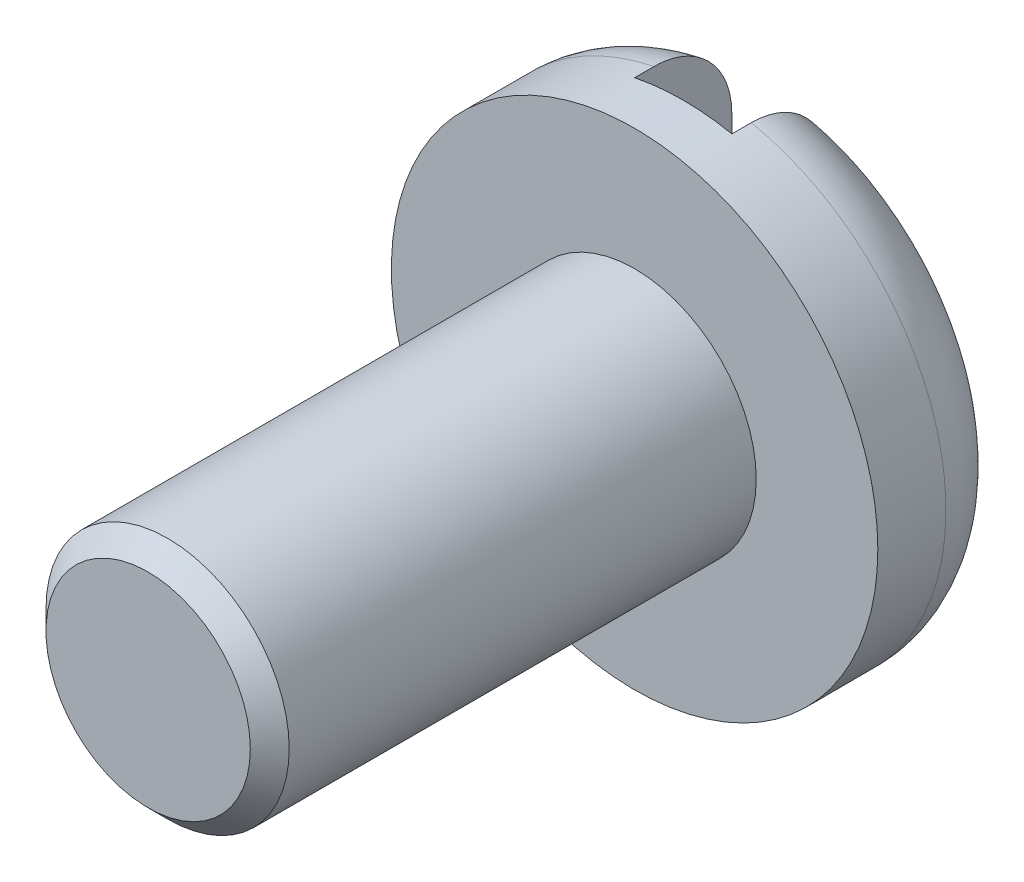
ISO-10303-21;
HEADER;
FILE_DESCRIPTION(('STEP AP214'),'2;1');
FILE_NAME('part.step','',(''),(''),'','','');
FILE_SCHEMA(('AUTOMOTIVE_DESIGN { 1 0 10303 214 1 1 1 1 }'));
ENDSEC;
DATA;
#1=APPLICATION_CONTEXT('core data for automotive mechanical design processes');
#2=APPLICATION_PROTOCOL_DEFINITION('international standard','automotive_design',2000,#1);
#3=PRODUCT_CONTEXT('',#1,'mechanical');
#4=PRODUCT('Part','Part','',(#3));
#5=PRODUCT_RELATED_PRODUCT_CATEGORY('part','',(#4));
#6=PRODUCT_DEFINITION_FORMATION('','',#4);
#7=PRODUCT_DEFINITION_CONTEXT('part definition',#1,'design');
#8=PRODUCT_DEFINITION('design','',#6,#7);
#9=PRODUCT_DEFINITION_SHAPE('','',#8);
#10=(LENGTH_UNIT() NAMED_UNIT(*) SI_UNIT(.MILLI.,.METRE.));
#11=(NAMED_UNIT(*) PLANE_ANGLE_UNIT() SI_UNIT($,.RADIAN.));
#12=(NAMED_UNIT(*) SI_UNIT($,.STERADIAN.) SOLID_ANGLE_UNIT());
#13=UNCERTAINTY_MEASURE_WITH_UNIT(LENGTH_MEASURE(1.E-05),#10,'distance_accuracy_value','');
#14=(GEOMETRIC_REPRESENTATION_CONTEXT(3) GLOBAL_UNCERTAINTY_ASSIGNED_CONTEXT((#13)) GLOBAL_UNIT_ASSIGNED_CONTEXT((#10,
#11,#12)) REPRESENTATION_CONTEXT('',''));
#15=CARTESIAN_POINT('',(0.,0.,0.));
#16=DIRECTION('',(0.,0.,1.));
#17=DIRECTION('',(1.,0.,0.));
#18=AXIS2_PLACEMENT_3D('',#15,#16,#17);
#19=CARTESIAN_POINT('',(0.,0.,0.));
#20=DIRECTION('',(0.,0.,1.));
#21=DIRECTION('',(1.,0.,0.));
#22=AXIS2_PLACEMENT_3D('',#19,#20,#21);
#23=PLANE('',#22);
#24=CARTESIAN_POINT('',(0.,0.,0.));
#25=DIRECTION('',(0.,0.,1.));
#26=DIRECTION('',(1.,0.,0.));
#27=AXIS2_PLACEMENT_3D('',#24,#25,#26);
#28=CIRCLE('',#27,1.7);
#29=CARTESIAN_POINT('',(-0.500000000000001,-1.62480768092719,0.));
#30=VERTEX_POINT('',#29);
#31=CARTESIAN_POINT('',(-0.500000000000001,1.62480768092719,0.));
#32=VERTEX_POINT('',#31);
#33=EDGE_CURVE('E109',#30,#32,#28,.F.);
#34=ORIENTED_EDGE('',*,*,#33,.T.);
#35=DIRECTION('',(0.,1.,0.));
#36=VECTOR('',#35,1.);
#37=CARTESIAN_POINT('',(-0.500000000000001,-2.5,0.));
#38=LINE('',#37,#36);
#39=EDGE_CURVE('E97',#30,#32,#38,.T.);
#40=ORIENTED_EDGE('',*,*,#39,.F.);
#41=EDGE_LOOP('',(#34,#40));
#42=FACE_BOUND('',#41,.T.);
#43=ADVANCED_FACE('F35',(#42),#23,.F.);
#44=CARTESIAN_POINT('',(0.,0.,0.8));
#45=DIRECTION('',(0.,0.,1.));
#46=DIRECTION('',(1.,0.,0.));
#47=AXIS2_PLACEMENT_3D('',#44,#45,#46);
#48=TOROIDAL_SURFACE('',#47,1.7,0.8);
#49=CARTESIAN_POINT('',(-0.500000000000001,-2.28874331554241,0.323650819477696));
#50=CARTESIAN_POINT('',(-0.500000000000001,-2.26114036429893,0.287268339331975));
#51=CARTESIAN_POINT('',(-0.500000000000001,-2.23039171511453,0.253243435037022));
#52=CARTESIAN_POINT('',(-0.500000000000001,-2.16356464521695,0.190870488722704));
#53=CARTESIAN_POINT('',(-0.500000000000001,-2.12748142920119,0.16252760891392));
#54=CARTESIAN_POINT('',(-0.500000000000001,-2.05114665205814,0.112302654126743));
#55=CARTESIAN_POINT('',(-0.500000000000001,-2.01090116213952,0.0904113433657712));
#56=CARTESIAN_POINT('',(-0.500000000000001,-1.92737765176059,0.0535347437293057));
#57=CARTESIAN_POINT('',(-0.500000000000001,-1.88410002914012,0.0385485507952723));
#58=CARTESIAN_POINT('',(-0.500000000000001,-1.79470614017092,0.0154852560090506));
#59=CARTESIAN_POINT('',(-0.500000000000001,-1.74854792735717,0.00757107878282026));
#60=CARTESIAN_POINT('',(-0.500000000000001,-1.6555620335874,-0.000715816322389249));
#61=CARTESIAN_POINT('',(-0.500000000000001,-1.6087342199035,-0.00108701770510398));
#62=CARTESIAN_POINT('',(-0.500000000000001,-1.51373377544026,0.00569146088522754));
#63=CARTESIAN_POINT('',(-0.500000000000001,-1.46558284561454,0.0131443513534284));
#64=CARTESIAN_POINT('',(-0.500000000000001,-1.37110277850981,0.0356724504904093));
#65=CARTESIAN_POINT('',(-0.500000000000001,-1.32477396689057,0.0507490150952296));
#66=CARTESIAN_POINT('',(-0.500000000000001,-1.23307588787986,0.0888458368378323));
#67=CARTESIAN_POINT('',(-0.500000000000001,-1.18784078995967,0.112189378280189));
#68=CARTESIAN_POINT('',(-0.500000000000001,-1.10177082448989,0.165981405406317));
#69=CARTESIAN_POINT('',(-0.500000000000001,-1.06093900715075,0.196434770524827));
#70=CARTESIAN_POINT('',(-0.500000000000001,-0.984042428578378,0.264486396411715));
#71=CARTESIAN_POINT('',(-0.500000000000001,-0.948106465376505,0.302230758233479));
#72=CARTESIAN_POINT('',(-0.500000000000001,-0.883601552966347,0.383564630786295));
#73=CARTESIAN_POINT('',(-0.500000000000001,-0.855024123716985,0.427147324479072));
#74=CARTESIAN_POINT('',(-0.500000000000001,-0.812387333487305,0.508752790510703));
#75=CARTESIAN_POINT('',(-0.5,-0.796508925893618,0.545826772162586));
#76=CARTESIAN_POINT('',(-0.5,-0.771146138368684,0.622090079098912));
#77=CARTESIAN_POINT('',(-0.5,-0.761653998327652,0.661276774373073));
#78=CARTESIAN_POINT('',(-0.5,-0.749750780601693,0.740903600043276));
#79=CARTESIAN_POINT('',(-0.5,-0.747370637963421,0.781348435359052));
#80=CARTESIAN_POINT('',(-0.5,-0.749998660963003,0.862001144874837));
#81=CARTESIAN_POINT('',(-0.5,-0.755007926373659,0.902208982908074));
#82=CARTESIAN_POINT('',(-0.5,-0.771405502563941,0.978483827606741));
#83=CARTESIAN_POINT('',(-0.5,-0.782349356960332,1.01464871343803));
#84=CARTESIAN_POINT('',(-0.5,-0.809605199069863,1.08488583012622));
#85=CARTESIAN_POINT('',(-0.5,-0.825919193529844,1.11895727303596));
#86=CARTESIAN_POINT('',(-0.5,-0.865017485064071,1.18769473333294));
#87=CARTESIAN_POINT('',(-0.5,-0.88828205807891,1.22208641993476));
#88=CARTESIAN_POINT('',(-0.5,-0.939510704162834,1.28716358947993));
#89=CARTESIAN_POINT('',(-0.5,-0.967477098685559,1.31784722870459));
#90=CARTESIAN_POINT('',(-0.5,-1.03203558688401,1.37955068281998));
#91=CARTESIAN_POINT('',(-0.5,-1.06929270768653,1.40987700451192));
#92=CARTESIAN_POINT('',(-0.5,-1.14805846285095,1.46439951703843));
#93=CARTESIAN_POINT('',(-0.5,-1.18956898422176,1.48859297036405));
#94=CARTESIAN_POINT('',(-0.5,-1.27921984301207,1.53188901336543));
#95=CARTESIAN_POINT('',(-0.5,-1.32762475814056,1.55044720328982));
#96=CARTESIAN_POINT('',(-0.5,-1.42688633267437,1.5790918815152));
#97=CARTESIAN_POINT('',(-0.5,-1.4777429998573,1.5891783429398));
#98=CARTESIAN_POINT('',(-0.5,-1.5799554393682,1.60032967120884));
#99=CARTESIAN_POINT('',(-0.5,-1.63130180650554,1.60147977726081));
#100=CARTESIAN_POINT('',(-0.5,-1.73340016007398,1.59472349847933));
#101=CARTESIAN_POINT('',(-0.5,-1.78415227787086,1.58681915493699));
#102=CARTESIAN_POINT('',(-0.5,-1.88121084816013,1.56254928582119));
#103=CARTESIAN_POINT('',(-0.5,-1.9276146476838,1.54657318847531));
#104=CARTESIAN_POINT('',(-0.5,-2.01689519429294,1.50671441065874));
#105=CARTESIAN_POINT('',(-0.5,-2.05977281476742,1.48283369546816));
#106=CARTESIAN_POINT('',(-0.5,-2.1388478080258,1.4289701999265));
#107=CARTESIAN_POINT('',(-0.5,-2.17525199432614,1.39929083317993));
#108=CARTESIAN_POINT('',(-0.5,-2.24236024629913,1.3340657500133));
#109=CARTESIAN_POINT('',(-0.5,-2.27306537721284,1.29852113224987));
#110=CARTESIAN_POINT('',(-0.5,-2.32692587572607,1.22377090521007));
#111=CARTESIAN_POINT('',(-0.5,-2.35028457656921,1.18471169975434));
#112=CARTESIAN_POINT('',(-0.5,-2.38996637287962,1.10317023826529));
#113=CARTESIAN_POINT('',(-0.5,-2.40629044684701,1.06068845928031));
#114=CARTESIAN_POINT('',(-0.5,-2.43114491891032,0.974374155691438));
#115=CARTESIAN_POINT('',(-0.5,-2.43981664414113,0.930582276526314));
#116=CARTESIAN_POINT('',(-0.5,-2.44961778250194,0.842155806149026));
#117=CARTESIAN_POINT('',(-0.5,-2.45074652176994,0.797521140002635));
#118=CARTESIAN_POINT('',(-0.5,-2.44544748516478,0.709065758285569));
#119=CARTESIAN_POINT('',(-0.5,-2.43908008616896,0.665241387768702));
#120=CARTESIAN_POINT('',(-0.5,-2.41908542871123,0.579306993586714));
#121=CARTESIAN_POINT('',(-0.500000000000001,-2.40546376838016,0.537195674892084));
#122=CARTESIAN_POINT('',(-0.500000000000001,-2.37554819358301,0.465766990240104));
#123=CARTESIAN_POINT('',(-0.500000000000001,-2.36071083679281,0.435829684720528));
#124=CARTESIAN_POINT('',(-0.500000000000001,-2.32738960380198,0.378059203540111));
#125=CARTESIAN_POINT('',(-0.500000000000001,-2.30890564398317,0.350226076149229));
#126=CARTESIAN_POINT('',(-0.500000000000001,-2.28874331554241,0.323650819477696));
#127=B_SPLINE_CURVE_WITH_KNOTS('',3,(#49,#50,#51,#52,#53,#54,#55,#56,#57,#58,#59,#60,#61,#62,
#63,#64,#65,#66,#67,#68,#69,#70,#71,#72,#73,#74,#75,#76,#77,#78,#79,#80,#81,#82,#83,#84,#85,#86,
#87,#88,#89,#90,#91,#92,#93,#94,#95,#96,#97,#98,#99,#100,#101,#102,#103,#104,#105,#106,#107,
#108,#109,#110,#111,#112,#113,#114,#115,#116,#117,#118,#119,#120,#121,#122,#123,#124,#125,#126),
.UNSPECIFIED.,.T.,.F.,(4,2,2,2,2,2,2,2,2,2,2,2,2,2,2,2,2,2,2,2,2,2,2,2,2,2,2,2,2,2,2,2,2,2,2,2,
2,2,4),(0.,0.136881394549618,0.27388659002408,0.410694691406685,0.547484875976824,
0.687350734904618,0.827244713232355,0.972767453847229,1.11831608604212,1.27033381460642,
1.422456180429,1.57802127977786,1.73340629395147,1.85390277662663,1.974252575353,
2.09512510290759,2.21601562185337,2.32889957027733,2.44182574984518,2.56591801756228,
2.69007173487407,2.83358293943035,2.9771580902733,3.13193403684145,3.28671047443141,
3.44000874638279,3.59327246462413,3.73976189740383,3.88621493667248,4.0264267751785,
4.16661237948574,4.30248203478868,4.43833278483534,4.57161864769022,4.70491641764374,
4.83714785856379,4.96927740371778,5.06925889915979,5.16924268748714),.UNSPECIFIED.);
#128=CARTESIAN_POINT('',(-0.5,-2.44948974278319,0.799999999999996));
#129=VERTEX_POINT('',#128);
#130=EDGE_CURVE('E150',#129,#30,#127,.T.);
#131=ORIENTED_EDGE('',*,*,#130,.F.);
#132=CARTESIAN_POINT('',(0.,0.,0.8));
#133=DIRECTION('',(0.,0.,1.));
#134=DIRECTION('',(1.,0.,0.));
#135=AXIS2_PLACEMENT_3D('',#132,#133,#134);
#136=CIRCLE('',#135,2.5);
#137=CARTESIAN_POINT('',(-0.5,2.44948974278318,0.8));
#138=VERTEX_POINT('',#137);
#139=EDGE_CURVE('E110',#138,#129,#136,.T.);
#140=ORIENTED_EDGE('',*,*,#139,.F.);
#141=CARTESIAN_POINT('',(-0.5,0.763174221656847,0.659811954428626));
#142=CARTESIAN_POINT('',(-0.5,0.772331814154018,0.616791501618094));
#143=CARTESIAN_POINT('',(-0.5,0.785637457387086,0.574595304416059));
#144=CARTESIAN_POINT('',(-0.5,0.819468072092881,0.493141336761603));
#145=CARTESIAN_POINT('',(-0.500000000000001,0.840015486973169,0.453893166773753));
#146=CARTESIAN_POINT('',(-0.500000000000001,0.886968000520788,0.37949235078692));
#147=CARTESIAN_POINT('',(-0.500000000000001,0.913330224003901,0.344312461405598));
#148=CARTESIAN_POINT('',(-0.500000000000001,0.970978659810408,0.278311502072106));
#149=CARTESIAN_POINT('',(-0.500000000000001,1.00226261428402,0.247488445666965));
#150=CARTESIAN_POINT('',(-0.500000000000001,1.07276119199498,0.187383352952656));
#151=CARTESIAN_POINT('',(-0.500000000000001,1.1124739316301,0.158684077285615));
#152=CARTESIAN_POINT('',(-0.500000000000001,1.19593546218382,0.107893211926669));
#153=CARTESIAN_POINT('',(-0.500000000000001,1.23968605159808,0.0858045854444577));
#154=CARTESIAN_POINT('',(-0.500000000000001,1.33290365964753,0.0477198308153603));
#155=CARTESIAN_POINT('',(-0.500000000000001,1.38255649516703,0.0321755190589856));
#156=CARTESIAN_POINT('',(-0.500000000000001,1.48379931985494,0.0098296013780624));
#157=CARTESIAN_POINT('',(-0.500000000000001,1.53538922076689,0.00302759763325178));
#158=CARTESIAN_POINT('',(-0.500000000000001,1.6379223848907,-0.0013684354334207));
#159=CARTESIAN_POINT('',(-0.500000000000001,1.68885760243432,0.00085395592663738));
#160=CARTESIAN_POINT('',(-0.500000000000001,1.7895420604932,0.0142448964950753));
#161=CARTESIAN_POINT('',(-0.500000000000001,1.83929159854554,0.0254111764361906));
#162=CARTESIAN_POINT('',(-0.500000000000001,1.93375644414651,0.055814320073775));
#163=CARTESIAN_POINT('',(-0.500000000000001,1.97859790105483,0.0746592898047138));
#164=CARTESIAN_POINT('',(-0.500000000000001,2.06428367144399,0.119921358057883));
#165=CARTESIAN_POINT('',(-0.500000000000001,2.10512892814823,0.146336663941436));
#166=CARTESIAN_POINT('',(-0.500000000000001,2.17990797385242,0.204802493642338));
#167=CARTESIAN_POINT('',(-0.500000000000001,2.21405534458713,0.236580027282969));
#168=CARTESIAN_POINT('',(-0.500000000000001,2.27633641886226,0.305565535359023));
#169=CARTESIAN_POINT('',(-0.500000000000001,2.30447117249583,0.342772559630028));
#170=CARTESIAN_POINT('',(-0.500000000000001,2.35310600138073,0.420405866510703));
#171=CARTESIAN_POINT('',(-0.5,2.37380055938078,0.460710402874505));
#172=CARTESIAN_POINT('',(-0.5,2.40799712964869,0.544263311497586));
#173=CARTESIAN_POINT('',(-0.5,2.421499903669,0.587511371431908));
#174=CARTESIAN_POINT('',(-0.5,2.44072101550054,0.674942720390497));
#175=CARTESIAN_POINT('',(-0.5,2.44656589400083,0.719098230129346));
#176=CARTESIAN_POINT('',(-0.5,2.45070647206463,0.807760967992679));
#177=CARTESIAN_POINT('',(-0.5,2.44900255977245,0.852268177915953));
#178=CARTESIAN_POINT('',(-0.5,2.43813466487342,0.940068141656114));
#179=CARTESIAN_POINT('',(-0.5,2.42901895524439,0.983366884341222));
#180=CARTESIAN_POINT('',(-0.5,2.40366854269914,1.06782581868695));
#181=CARTESIAN_POINT('',(-0.5,2.38743387042699,1.10898601955221));
#182=CARTESIAN_POINT('',(-0.5,2.34827807554031,1.18814603686837));
#183=CARTESIAN_POINT('',(-0.5,2.32533680411611,1.22613587984183));
#184=CARTESIAN_POINT('',(-0.5,2.27347608457476,1.29778521494614));
#185=CARTESIAN_POINT('',(-0.5,2.24455639883606,1.3314445348672));
#186=CARTESIAN_POINT('',(-0.5,2.18119044241025,1.39395004601981));
#187=CARTESIAN_POINT('',(-0.5,2.14667918831962,1.42273031919211));
#188=CARTESIAN_POINT('',(-0.5,2.07340639416328,1.4742382623777));
#189=CARTESIAN_POINT('',(-0.5,2.03464449295663,1.49696541754627));
#190=CARTESIAN_POINT('',(-0.5,1.95303811528246,1.53630238455382));
#191=CARTESIAN_POINT('',(-0.5,1.91012056759754,1.55276047802607));
#192=CARTESIAN_POINT('',(-0.5,1.82218864173889,1.57849642541413));
#193=CARTESIAN_POINT('',(-0.5,1.77717398287076,1.58777331519496));
#194=CARTESIAN_POINT('',(-0.5,1.68470522859116,1.59924404255415));
#195=CARTESIAN_POINT('',(-0.5,1.63722014251212,1.6011874200712));
#196=CARTESIAN_POINT('',(-0.5,1.5425575339832,1.59742230557488));
#197=CARTESIAN_POINT('',(-0.5,1.49538007787586,1.59171221452671));
#198=CARTESIAN_POINT('',(-0.5,1.40049833783991,1.57254160239932));
#199=CARTESIAN_POINT('',(-0.5,1.35285973071404,1.55875612029233));
#200=CARTESIAN_POINT('',(-0.5,1.26041918385205,1.52370363836635));
#201=CARTESIAN_POINT('',(-0.5,1.21561788271365,1.50243496130257));
#202=CARTESIAN_POINT('',(-0.5,1.12822640720904,1.45201502690669));
#203=CARTESIAN_POINT('',(-0.5,1.08580095370756,1.42257763954293));
#204=CARTESIAN_POINT('',(-0.5,1.00645718590255,1.35697223287792));
#205=CARTESIAN_POINT('',(-0.5,0.969542424053088,1.32079990538474));
#206=CARTESIAN_POINT('',(-0.5,0.902728202062678,1.24264657458328));
#207=CARTESIAN_POINT('',(-0.5,0.872805362508934,1.20068569786276));
#208=CARTESIAN_POINT('',(-0.5,0.821495500185771,1.11181125270917));
#209=CARTESIAN_POINT('',(-0.5,0.800098767174895,1.06490339578655));
#210=CARTESIAN_POINT('',(-0.5,0.769586397916529,0.973276233502064));
#211=CARTESIAN_POINT('',(-0.5,0.759329706031753,0.928939457996654));
#212=CARTESIAN_POINT('',(-0.5,0.747972814005023,0.839172435724715));
#213=CARTESIAN_POINT('',(-0.5,0.746844399408318,0.793745993947883));
#214=CARTESIAN_POINT('',(-0.5,0.751456770458611,0.733809167422154));
#215=CARTESIAN_POINT('',(-0.5,0.753114886460292,0.718903739284091));
#216=CARTESIAN_POINT('',(-0.5,0.757412894049379,0.689237621311714));
#217=CARTESIAN_POINT('',(-0.5,0.760052553488418,0.674476898099307));
#218=CARTESIAN_POINT('',(-0.5,0.763174221656847,0.659811954428626));
#219=B_SPLINE_CURVE_WITH_KNOTS('',3,(#141,#142,#143,#144,#145,#146,#147,#148,#149,#150,#151,
#152,#153,#154,#155,#156,#157,#158,#159,#160,#161,#162,#163,#164,#165,#166,#167,#168,#169,#170,
#171,#172,#173,#174,#175,#176,#177,#178,#179,#180,#181,#182,#183,#184,#185,#186,#187,#188,#189,
#190,#191,#192,#193,#194,#195,#196,#197,#198,#199,#200,#201,#202,#203,#204,#205,#206,#207,#208,
#209,#210,#211,#212,#213,#214,#215,#216,#217,#218),.UNSPECIFIED.,.T.,.F.,(4,2,2,2,2,2,2,2,2,2,2,
2,2,2,2,2,2,2,2,2,2,2,2,2,2,2,2,2,2,2,2,2,2,2,2,2,2,2,4),(0.,0.131887756951396,
0.264187902383391,0.395543342550973,0.526838698034712,0.673201171907094,0.819629154526515,
0.974955601115857,1.13027497929768,1.28245075571727,1.43458793391893,1.57977666663049,
1.72493104734178,1.86417988002311,2.0034043732265,2.13866681072614,2.27391491840247,
2.40689873154788,2.53987570700079,2.67199347672475,2.80411067774409,2.93662895422174,
3.06915249886153,3.20334417532375,3.33754726174509,3.47481821479275,3.61210759438712,
3.75404544929164,3.89601296381403,4.04412910393722,4.1922784632201,4.34647051965278,
4.5007615503203,4.65452903791529,4.80812089828802,4.94380436224962,5.07906828337564,
5.1240372147745,5.16899551716762),.UNSPECIFIED.);
#220=EDGE_CURVE('E106',#32,#138,#219,.T.);
#221=ORIENTED_EDGE('',*,*,#220,.F.);
#222=ORIENTED_EDGE('',*,*,#33,.F.);
#223=EDGE_LOOP('',(#131,#140,#221,#222));
#224=FACE_BOUND('',#223,.T.);
#225=ADVANCED_FACE('F166',(#224),#48,.T.);
#226=CARTESIAN_POINT('',(0.,0.,1.5));
#227=DIRECTION('',(0.,0.,1.));
#228=DIRECTION('',(1.,0.,0.));
#229=AXIS2_PLACEMENT_3D('',#226,#227,#228);
#230=PLANE('',#229);
#231=CARTESIAN_POINT('',(0.,0.,1.5));
#232=DIRECTION('',(0.,0.,1.));
#233=DIRECTION('',(1.,0.,0.));
#234=AXIS2_PLACEMENT_3D('',#231,#232,#233);
#235=CIRCLE('',#234,2.5);
#236=CARTESIAN_POINT('',(2.5,0.,1.5));
#237=VERTEX_POINT('',#236);
#238=EDGE_CURVE('E178',#237,#237,#235,.T.);
#239=ORIENTED_EDGE('',*,*,#238,.T.);
#240=EDGE_LOOP('',(#239));
#241=FACE_BOUND('',#240,.T.);
#242=CARTESIAN_POINT('',(0.,0.,1.5));
#243=DIRECTION('',(0.,0.,1.));
#244=DIRECTION('',(1.,0.,0.));
#245=AXIS2_PLACEMENT_3D('',#242,#243,#244);
#246=CIRCLE('',#245,1.25);
#247=CARTESIAN_POINT('',(1.25,0.,1.5));
#248=VERTEX_POINT('',#247);
#249=EDGE_CURVE('E176',#248,#248,#246,.T.);
#250=ORIENTED_EDGE('',*,*,#249,.F.);
#251=EDGE_LOOP('',(#250));
#252=FACE_BOUND('',#251,.T.);
#253=ADVANCED_FACE('F183',(#241,#252),#230,.T.);
#254=CARTESIAN_POINT('',(0.,0.,1.5));
#255=DIRECTION('',(0.,0.,-1.));
#256=DIRECTION('',(-1.,0.,0.));
#257=AXIS2_PLACEMENT_3D('',#254,#255,#256);
#258=CYLINDRICAL_SURFACE('',#257,2.5);
#259=CARTESIAN_POINT('',(0.5,-2.44948974278318,0.8));
#260=VERTEX_POINT('',#259);
#261=CARTESIAN_POINT('',(0.5,2.44948974278318,0.8));
#262=VERTEX_POINT('',#261);
#263=EDGE_CURVE('E105',#260,#262,#136,.T.);
#264=ORIENTED_EDGE('',*,*,#263,.T.);
#265=DIRECTION('',(0.,0.,-1.));
#266=VECTOR('',#265,1.);
#267=CARTESIAN_POINT('',(0.5,2.44948974278318,1.5));
#268=LINE('',#267,#266);
#269=CARTESIAN_POINT('',(0.5,2.44948974278318,1.));
#270=VERTEX_POINT('',#269);
#271=EDGE_CURVE('E50',#262,#270,#268,.F.);
#272=ORIENTED_EDGE('',*,*,#271,.T.);
#273=CARTESIAN_POINT('',(0.,0.,1.));
#274=DIRECTION('',(0.,0.,1.));
#275=DIRECTION('',(1.,0.,0.));
#276=AXIS2_PLACEMENT_3D('',#273,#274,#275);
#277=CIRCLE('',#276,2.5);
#278=CARTESIAN_POINT('',(-0.5,2.44948974278318,1.));
#279=VERTEX_POINT('',#278);
#280=EDGE_CURVE('E39',#270,#279,#277,.T.);
#281=ORIENTED_EDGE('',*,*,#280,.T.);
#282=DIRECTION('',(0.,0.,-1.));
#283=VECTOR('',#282,1.);
#284=CARTESIAN_POINT('',(-0.5,2.44948974278318,1.5));
#285=LINE('',#284,#283);
#286=EDGE_CURVE('E157',#279,#138,#285,.T.);
#287=ORIENTED_EDGE('',*,*,#286,.T.);
#288=ORIENTED_EDGE('',*,*,#139,.T.);
#289=DIRECTION('',(0.,0.,-1.));
#290=VECTOR('',#289,1.);
#291=CARTESIAN_POINT('',(-0.5,-2.44948974278318,1.5));
#292=LINE('',#291,#290);
#293=CARTESIAN_POINT('',(-0.5,-2.44948974278318,1.));
#294=VERTEX_POINT('',#293);
#295=EDGE_CURVE('E58',#129,#294,#292,.F.);
#296=ORIENTED_EDGE('',*,*,#295,.T.);
#297=CARTESIAN_POINT('',(0.5,-2.44948974278318,1.));
#298=VERTEX_POINT('',#297);
#299=EDGE_CURVE('E11',#294,#298,#277,.T.);
#300=ORIENTED_EDGE('',*,*,#299,.T.);
#301=DIRECTION('',(0.,0.,-1.));
#302=VECTOR('',#301,1.);
#303=CARTESIAN_POINT('',(0.5,-2.44948974278318,1.5));
#304=LINE('',#303,#302);
#305=EDGE_CURVE('E164',#298,#260,#304,.T.);
#306=ORIENTED_EDGE('',*,*,#305,.T.);
#307=EDGE_LOOP('',(#264,#272,#281,#287,#288,#296,#300,#306));
#308=FACE_BOUND('',#307,.T.);
#309=ORIENTED_EDGE('',*,*,#238,.F.);
#310=EDGE_LOOP('',(#309));
#311=FACE_BOUND('',#310,.T.);
#312=ADVANCED_FACE('F37',(#308,#311),#258,.T.);
#313=CARTESIAN_POINT('',(0.5,1.62480768092703,0.));
#314=VERTEX_POINT('',#313);
#315=CARTESIAN_POINT('',(0.5,-1.62480768092719,0.));
#316=VERTEX_POINT('',#315);
#317=EDGE_CURVE('E103',#314,#316,#28,.F.);
#318=ORIENTED_EDGE('',*,*,#317,.T.);
#319=DIRECTION('',(0.,1.,0.));
#320=VECTOR('',#319,1.);
#321=CARTESIAN_POINT('',(0.5,-2.5,0.));
#322=LINE('',#321,#320);
#323=EDGE_CURVE('E88',#316,#314,#322,.T.);
#324=ORIENTED_EDGE('',*,*,#323,.T.);
#325=EDGE_LOOP('',(#318,#324));
#326=FACE_BOUND('',#325,.T.);
#327=ADVANCED_FACE('F108',(#326),#23,.F.);
#328=CARTESIAN_POINT('',(0.500000000093728,-2.28874331560521,0.323650819430055));
#329=CARTESIAN_POINT('',(0.500000000100303,-2.315559312022,0.35900064362154));
#330=CARTESIAN_POINT('',(0.500000000026882,-2.33942714754377,0.396603600533185));
#331=CARTESIAN_POINT('',(0.499999999973105,-2.38053527090813,0.475291426716204));
#332=CARTESIAN_POINT('',(0.499999999992793,-2.3977725251582,0.516377879274061));
#333=CARTESIAN_POINT('',(0.500000000007208,-2.42508274327751,0.600878982870124));
#334=CARTESIAN_POINT('',(0.500000000001931,-2.43515428445711,0.644294094404208));
#335=CARTESIAN_POINT('',(0.499999999998069,-2.44781259566677,0.732198265905145));
#336=CARTESIAN_POINT('',(0.499999999999484,-2.45040013886953,0.776687214454896));
#337=CARTESIAN_POINT('',(0.500000000000512,-2.44802001982261,0.865187043359456));
#338=CARTESIAN_POINT('',(0.500000000000137,-2.44309880911236,0.909199180364504));
#339=CARTESIAN_POINT('',(0.499999999999862,-2.42593846223471,0.995771672697424));
#340=CARTESIAN_POINT('',(0.499999999999963,-2.41369937338695,1.03833203741102));
#341=CARTESIAN_POINT('',(0.500000000000037,-2.38227161201386,1.12082016436781));
#342=CARTESIAN_POINT('',(0.50000000000001,-2.36308039194016,1.16074695521257));
#343=CARTESIAN_POINT('',(0.49999999999999,-2.31832913559003,1.23685286303461));
#344=CARTESIAN_POINT('',(0.499999999999997,-2.29276892105601,1.27303187507765));
#345=CARTESIAN_POINT('',(0.500000000000003,-2.23575808077971,1.34101294643527));
#346=CARTESIAN_POINT('',(0.500000000000001,-2.20425207801221,1.37276853711454));
#347=CARTESIAN_POINT('',(0.499999999999999,-2.1364472790855,1.43066099575651));
#348=CARTESIAN_POINT('',(0.5,-2.10014814761786,1.45679747029146));
#349=CARTESIAN_POINT('',(0.5,-2.02303372689779,1.50328801719942));
#350=CARTESIAN_POINT('',(0.5,-1.98214312074649,1.52351706853825));
#351=CARTESIAN_POINT('',(0.5,-1.89761919251273,1.5570504021218));
#352=CARTESIAN_POINT('',(0.5,-1.85398553882598,1.57035384532552));
#353=CARTESIAN_POINT('',(0.5,-1.76379211011943,1.59012097510188));
#354=CARTESIAN_POINT('',(0.5,-1.71718362468937,1.59636205682599));
#355=CARTESIAN_POINT('',(0.5,-1.62357364476613,1.60125923038829));
#356=CARTESIAN_POINT('',(0.5,-1.57657207797541,1.59991389483209));
#357=CARTESIAN_POINT('',(0.5,-1.48145127723886,1.58963060198645));
#358=CARTESIAN_POINT('',(0.5,-1.43336562358239,1.58038253133494));
#359=CARTESIAN_POINT('',(0.5,-1.33930352317971,1.55429470641535));
#360=CARTESIAN_POINT('',(0.5,-1.29332746417287,1.53745356266449));
#361=CARTESIAN_POINT('',(0.5,-1.20266365062088,1.49582407360575));
#362=CARTESIAN_POINT('',(0.5,-1.15812091093502,1.47071948147013));
#363=CARTESIAN_POINT('',(0.5,-1.07374155296779,1.4134995318306));
#364=CARTESIAN_POINT('',(0.5,-1.03390842823536,1.38137901965017));
#365=CARTESIAN_POINT('',(0.5,-0.959602055590272,1.31028108621291));
#366=CARTESIAN_POINT('',(0.5,-0.925228992801346,1.27119848805353));
#367=CARTESIAN_POINT('',(0.5,-0.864203214635992,1.18741391846435));
#368=CARTESIAN_POINT('',(0.5,-0.837539535940462,1.14272005777978));
#369=CARTESIAN_POINT('',(0.5,-0.798914403402563,1.05997290157692));
#370=CARTESIAN_POINT('',(0.5,-0.784967955085893,1.02284395840939));
#371=CARTESIAN_POINT('',(0.5,-0.763479012608538,0.946789156008464));
#372=CARTESIAN_POINT('',(0.5,-0.755928802267976,0.907865521794916));
#373=CARTESIAN_POINT('',(0.5,-0.747797948416124,0.829152686995624));
#374=CARTESIAN_POINT('',(0.5,-0.74724086982587,0.789361012213337));
#375=CARTESIAN_POINT('',(0.5,-0.753207715939333,0.710306700248027));
#376=CARTESIAN_POINT('',(0.5,-0.759734118405223,0.671044253050961));
#377=CARTESIAN_POINT('',(0.5,-0.77886829332628,0.596029646953938));
#378=CARTESIAN_POINT('',(0.5,-0.791175369860704,0.560199247681522));
#379=CARTESIAN_POINT('',(0.5,-0.821008589376878,0.49079310547325));
#380=CARTESIAN_POINT('',(0.5,-0.838536589005676,0.457218169831953));
#381=CARTESIAN_POINT('',(0.5,-0.880353106909084,0.389121692820166));
#382=CARTESIAN_POINT('',(0.5,-0.905187742906542,0.354936479215602));
#383=CARTESIAN_POINT('',(0.5,-0.95952918055647,0.29051128800651));
#384=CARTESIAN_POINT('',(0.5,-0.989038432063091,0.260273394339833));
#385=CARTESIAN_POINT('',(0.499999999999999,-1.05673953210302,0.199928031618317));
#386=CARTESIAN_POINT('',(0.499999999999999,-1.09556950727487,0.170533737841136));
#387=CARTESIAN_POINT('',(0.500000000000001,-1.17736087015443,0.118187492212579));
#388=CARTESIAN_POINT('',(0.500000000000003,-1.22032389164144,0.0952381021756298));
#389=CARTESIAN_POINT('',(0.499999999999996,-1.31229146347601,0.0550952736258997));
#390=CARTESIAN_POINT('',(0.499999999999986,-1.36150768712376,0.0383836269800471));
#391=CARTESIAN_POINT('',(0.500000000000013,-1.4620766253842,0.0136089998737299));
#392=CARTESIAN_POINT('',(0.500000000000051,-1.51342922415706,0.00554555111864054));
#393=CARTESIAN_POINT('',(0.499999999999949,-1.61591182334996,-0.00142458275158967));
#394=CARTESIAN_POINT('',(0.499999999999812,-1.6670315614161,-0.00047988397104575));
#395=CARTESIAN_POINT('',(0.500000000000187,-1.76831626471195,0.0104046203835116));
#396=CARTESIAN_POINT('',(0.500000000000698,-1.81848133230326,0.020343455977294));
#397=CARTESIAN_POINT('',(0.499999999999333,-1.91399922888033,0.0484482214926761));
#398=CARTESIAN_POINT('',(0.499999999997562,-1.95946702337624,0.0662238356174303));
#399=CARTESIAN_POINT('',(0.500000000002435,-2.04655633632262,0.109475361491232));
#400=CARTESIAN_POINT('',(0.500000000009071,-2.0881812808548,0.134944325981582));
#401=CARTESIAN_POINT('',(0.499999999992904,-2.15770228849185,0.186557760102302));
#402=CARTESIAN_POINT('',(0.499999999976198,-2.18661414299778,0.211347463930065));
#403=CARTESIAN_POINT('',(0.500000000023799,-2.24065217467165,0.264757890260935));
#404=CARTESIAN_POINT('',(0.500000000088097,-2.26577880034592,0.293378158125902));
#405=CARTESIAN_POINT('',(0.500000000093728,-2.28874331560521,0.323650819430055));
#406=B_SPLINE_CURVE_WITH_KNOTS('',3,(#328,#329,#330,#331,#332,#333,#334,#335,#336,#337,#338,
#339,#340,#341,#342,#343,#344,#345,#346,#347,#348,#349,#350,#351,#352,#353,#354,#355,#356,#357,
#358,#359,#360,#361,#362,#363,#364,#365,#366,#367,#368,#369,#370,#371,#372,#373,#374,#375,#376,
#377,#378,#379,#380,#381,#382,#383,#384,#385,#386,#387,#388,#389,#390,#391,#392,#393,#394,#395,
#396,#397,#398,#399,#400,#401,#402,#403,#404,#405),.UNSPECIFIED.,.T.,.F.,(4,2,2,2,2,2,2,2,2,2,2,
2,2,2,2,2,2,2,2,2,2,2,2,2,2,2,2,2,2,2,2,2,2,2,2,2,2,2,4),(0.,0.132976304755247,
0.266013376051209,0.399076853328563,0.53212658331143,0.664356556125577,0.796585673909572,
0.928863295005767,1.06114461874885,1.19472489648326,1.32831452392368,1.46455476918313,
1.60081151617964,1.74125287498452,1.88172065889731,2.02796784848848,2.17424181122886,
2.32693315574166,2.47973706395757,2.63508288397761,2.79020669171181,2.90869707713831,
3.0270443158595,3.1457902454283,3.26457772505167,3.37777412573008,3.49101082908808,
3.61728910490484,3.74363378043123,3.889111354972,4.03464667447712,4.18981930400381,
4.34498353060326,4.49759235063194,4.65018471439551,4.79591091679353,4.94150591674835,
5.05539683816263,5.16927425417261),.UNSPECIFIED.);
#407=EDGE_CURVE('E91',#316,#260,#406,.T.);
#408=ORIENTED_EDGE('',*,*,#407,.F.);
#409=ORIENTED_EDGE('',*,*,#317,.F.);
#410=CARTESIAN_POINT('',(0.499999999866592,0.763174221585486,0.659811954413441));
#411=CARTESIAN_POINT('',(0.499999999856742,0.755128241800932,0.697637658691459));
#412=CARTESIAN_POINT('',(0.499999999961612,0.750272261662242,0.736162112682446));
#413=CARTESIAN_POINT('',(0.500000000038397,0.747344012455467,0.813477680832981));
#414=CARTESIAN_POINT('',(0.500000000010279,0.749273392255452,0.852268857521216));
#415=CARTESIAN_POINT('',(0.499999999989742,0.759742601963353,0.928849926884748));
#416=CARTESIAN_POINT('',(0.499999999997247,0.76826843847196,0.966641764217874));
#417=CARTESIAN_POINT('',(0.500000000002754,0.791294609047629,1.04035361164927));
#418=CARTESIAN_POINT('',(0.500000000000752,0.805798320822255,1.07627255054816));
#419=CARTESIAN_POINT('',(0.499999999999218,0.84066813001304,1.14692801414532));
#420=CARTESIAN_POINT('',(0.499999999999789,0.861246443307496,1.18155897100413));
#421=CARTESIAN_POINT('',(0.50000000000021,0.907144052288203,1.2475073870028));
#422=CARTESIAN_POINT('',(0.50000000000006,0.932464952784495,1.27882371889989));
#423=CARTESIAN_POINT('',(0.49999999999993,0.991515580903194,1.34247459174971));
#424=CARTESIAN_POINT('',(0.499999999999981,1.02594272048022,1.37416360159459));
#425=CARTESIAN_POINT('',(0.500000000000019,1.09921239438027,1.43195423042218));
#426=CARTESIAN_POINT('',(0.500000000000005,1.13805727886677,1.45805285392913));
#427=CARTESIAN_POINT('',(0.499999999999994,1.22324300274002,1.50637268523254));
#428=CARTESIAN_POINT('',(0.499999999999998,1.26994533731551,1.52796034332847));
#429=CARTESIAN_POINT('',(0.500000000000002,1.36630568548363,1.56303563158212));
#430=CARTESIAN_POINT('',(0.5,1.41596393846186,1.57652260472079));
#431=CARTESIAN_POINT('',(0.499999999999999,1.51708850766439,1.59487850846086));
#432=CARTESIAN_POINT('',(0.5,1.56856183723706,1.59970913581281));
#433=CARTESIAN_POINT('',(0.5,1.67156308711474,1.6002651590816));
#434=CARTESIAN_POINT('',(0.5,1.72309099451217,1.5959923674315));
#435=CARTESIAN_POINT('',(0.5,1.82245545012045,1.578625636683));
#436=CARTESIAN_POINT('',(0.5,1.87035663669879,1.56590205137859));
#437=CARTESIAN_POINT('',(0.5,1.96317342786508,1.53221927206281));
#438=CARTESIAN_POINT('',(0.5,2.00808979212201,1.51126218302377));
#439=CARTESIAN_POINT('',(0.5,2.09154347911499,1.46273851871509));
#440=CARTESIAN_POINT('',(0.5,2.13027539748027,1.43550640882506));
#441=CARTESIAN_POINT('',(0.5,2.20241232228544,1.37471861424286));
#442=CARTESIAN_POINT('',(0.5,2.2358184024214,1.34116420711789));
#443=CARTESIAN_POINT('',(0.5,2.29519540735747,1.26991069979237));
#444=CARTESIAN_POINT('',(0.5,2.32137714237419,1.23238714848039));
#445=CARTESIAN_POINT('',(0.5,2.36690921141864,1.15340155225496));
#446=CARTESIAN_POINT('',(0.5,2.38626043946522,1.11194002367044));
#447=CARTESIAN_POINT('',(0.5,2.41717906805752,1.02720467118758));
#448=CARTESIAN_POINT('',(0.5,2.42890230175895,0.983987653091296));
#449=CARTESIAN_POINT('',(0.5,2.44484245769338,0.896191280910922));
#450=CARTESIAN_POINT('',(0.5,2.44905991696888,0.851612024527948));
#451=CARTESIAN_POINT('',(0.5,2.44985294053314,0.762848438891225));
#452=CARTESIAN_POINT('',(0.5,2.44650702145899,0.718664788847893));
#453=CARTESIAN_POINT('',(0.5,2.43243851966245,0.631489326391275));
#454=CARTESIAN_POINT('',(0.5,2.42171610065241,0.588497487549235));
#455=CARTESIAN_POINT('',(0.5,2.39323237528168,0.504945079201687));
#456=CARTESIAN_POINT('',(0.5,2.37547552063256,0.464382990692862));
#457=CARTESIAN_POINT('',(0.5,2.33346079336099,0.386781108874723));
#458=CARTESIAN_POINT('',(0.5,2.30920277014939,0.349741397182561));
#459=CARTESIAN_POINT('',(0.5,2.2546676077786,0.279869842574899));
#460=CARTESIAN_POINT('',(0.5,2.22433935261417,0.247077920139465));
#461=CARTESIAN_POINT('',(0.5,2.15869818545801,0.186939777023172));
#462=CARTESIAN_POINT('',(0.5,2.12338494678459,0.159593913523096));
#463=CARTESIAN_POINT('',(0.5,2.04808553002206,0.110552985123281));
#464=CARTESIAN_POINT('',(0.5,2.00802418271871,0.0889734195204285));
#465=CARTESIAN_POINT('',(0.5,1.92492490359931,0.0526307103054972));
#466=CARTESIAN_POINT('',(0.499999999999999,1.88188662640382,0.0378683591478589));
#467=CARTESIAN_POINT('',(0.5,1.79270740371887,0.0150869751973856));
#468=CARTESIAN_POINT('',(0.500000000000001,1.74651236312658,0.00727999438224346));
#469=CARTESIAN_POINT('',(0.499999999999998,1.65347180979192,-0.000787375252723173));
#470=CARTESIAN_POINT('',(0.499999999999994,1.60662618013028,-0.00104638957761565));
#471=CARTESIAN_POINT('',(0.500000000000005,1.51160913992973,0.00596244520762103));
#472=CARTESIAN_POINT('',(0.500000000000021,1.46346014440026,0.0135333144190071));
#473=CARTESIAN_POINT('',(0.499999999999978,1.36900396423007,0.0362955218906589));
#474=CARTESIAN_POINT('',(0.499999999999919,1.32269706604067,0.0514880403779735));
#475=CARTESIAN_POINT('',(0.500000000000084,1.23106698398553,0.0898157103681058));
#476=CARTESIAN_POINT('',(0.500000000000322,1.18587850505854,0.113273228828164));
#477=CARTESIAN_POINT('',(0.499999999999677,1.099913670521,0.167291275935953));
#478=CARTESIAN_POINT('',(0.499999999998793,1.05914111230223,0.197857847911222));
#479=CARTESIAN_POINT('',(0.500000000001234,0.982389805354523,0.266128810369599));
#480=CARTESIAN_POINT('',(0.500000000004654,0.946540299334672,0.303978970683941));
#481=CARTESIAN_POINT('',(0.499999999995354,0.882260719696499,0.385491514328135));
#482=CARTESIAN_POINT('',(0.499999999982667,0.85381586535386,0.429142051922826));
#483=CARTESIAN_POINT('',(0.500000000010985,0.814828285597231,0.504294081841598));
#484=CARTESIAN_POINT('',(0.500000000034031,0.801544321060747,0.534390937195383));
#485=CARTESIAN_POINT('',(0.499999999965986,0.779133450428986,0.596095183980098));
#486=CARTESIAN_POINT('',(0.499999999874954,0.770004435516674,0.627701800120898));
#487=CARTESIAN_POINT('',(0.499999999866592,0.763174221585486,0.659811954413441));
#488=B_SPLINE_CURVE_WITH_KNOTS('',3,(#410,#411,#412,#413,#414,#415,#416,#417,#418,#419,#420,
#421,#422,#423,#424,#425,#426,#427,#428,#429,#430,#431,#432,#433,#434,#435,#436,#437,#438,#439,
#440,#441,#442,#443,#444,#445,#446,#447,#448,#449,#450,#451,#452,#453,#454,#455,#456,#457,#458,
#459,#460,#461,#462,#463,#464,#465,#466,#467,#468,#469,#470,#471,#472,#473,#474,#475,#476,#477,
#478,#479,#480,#481,#482,#483,#484,#485,#486,#487),.UNSPECIFIED.,.T.,.F.,(4,2,2,2,2,2,2,2,2,2,2,
2,2,2,2,2,2,2,2,2,2,2,2,2,2,2,2,2,2,2,2,2,2,2,2,2,2,2,4),(0.,0.115897048156696,
0.231822261679262,0.34750222915146,0.463247649633455,0.583645704626677,0.704084574099274,
0.843883680184592,0.983757507949577,1.13738421840653,1.29102338732222,1.44534072722539,
1.59962734639451,1.74756291214343,1.89546068136568,2.03679719893376,2.1781051867419,
2.31470047770871,2.4512778836066,2.58496939407725,2.7186513384584,2.85095189001033,
2.98324950540907,3.11546353025111,3.24768061788423,3.38106183833802,3.5144518037451,
3.65034149316649,3.78624697485887,3.92616661468287,4.06611173390381,4.21168304766608,
4.35727691038757,4.50932772160796,4.66150826505948,4.81712986855955,4.97243840523826,
5.07087316147609,5.16925790194276),.UNSPECIFIED.);
#489=EDGE_CURVE('E93',#262,#314,#488,.T.);
#490=ORIENTED_EDGE('',*,*,#489,.F.);
#491=ORIENTED_EDGE('',*,*,#263,.F.);
#492=EDGE_LOOP('',(#408,#409,#490,#491));
#493=FACE_BOUND('',#492,.T.);
#494=ADVANCED_FACE('F102',(#493),#48,.T.);
#495=CARTESIAN_POINT('',(0.,0.,6.5));
#496=DIRECTION('',(0.,0.,-1.));
#497=DIRECTION('',(-1.,0.,0.));
#498=AXIS2_PLACEMENT_3D('',#495,#496,#497);
#499=CYLINDRICAL_SURFACE('',#498,1.25);
#500=CARTESIAN_POINT('',(0.,0.,6.3));
#501=DIRECTION('',(0.,0.,1.));
#502=DIRECTION('',(1.,0.,0.));
#503=AXIS2_PLACEMENT_3D('',#500,#501,#502);
#504=CIRCLE('',#503,1.25);
#505=CARTESIAN_POINT('',(1.25,0.,6.3));
#506=VERTEX_POINT('',#505);
#507=EDGE_CURVE('E120',#506,#506,#504,.F.);
#508=ORIENTED_EDGE('',*,*,#507,.T.);
#509=EDGE_LOOP('',(#508));
#510=FACE_BOUND('',#509,.T.);
#511=ORIENTED_EDGE('',*,*,#249,.T.);
#512=EDGE_LOOP('',(#511));
#513=FACE_BOUND('',#512,.T.);
#514=ADVANCED_FACE('F197',(#510,#513),#499,.T.);
#515=CARTESIAN_POINT('',(0.,0.,6.5));
#516=DIRECTION('',(0.,0.,1.));
#517=DIRECTION('',(1.,0.,0.));
#518=AXIS2_PLACEMENT_3D('',#515,#516,#517);
#519=PLANE('',#518);
#520=CARTESIAN_POINT('',(0.,0.,6.5));
#521=DIRECTION('',(0.,0.,1.));
#522=DIRECTION('',(1.,0.,0.));
#523=AXIS2_PLACEMENT_3D('',#520,#521,#522);
#524=CIRCLE('',#523,1.05);
#525=CARTESIAN_POINT('',(1.05,0.,6.5));
#526=VERTEX_POINT('',#525);
#527=EDGE_CURVE('E113',#526,#526,#524,.T.);
#528=ORIENTED_EDGE('',*,*,#527,.T.);
#529=EDGE_LOOP('',(#528));
#530=FACE_BOUND('',#529,.T.);
#531=ADVANCED_FACE('F201',(#530),#519,.T.);
#532=CARTESIAN_POINT('',(0.,0.,6.5));
#533=DIRECTION('',(0.,0.,-1.));
#534=DIRECTION('',(-1.,0.,0.));
#535=AXIS2_PLACEMENT_3D('',#532,#533,#534);
#536=CONICAL_SURFACE('',#535,1.05,0.785398163397454);
#537=ORIENTED_EDGE('',*,*,#507,.F.);
#538=EDGE_LOOP('',(#537));
#539=FACE_BOUND('',#538,.T.);
#540=ORIENTED_EDGE('',*,*,#527,.F.);
#541=EDGE_LOOP('',(#540));
#542=FACE_BOUND('',#541,.T.);
#543=ADVANCED_FACE('F141',(#539,#542),#536,.T.);
#544=CARTESIAN_POINT('',(-0.5,-2.5,1.));
#545=DIRECTION('',(0.,0.,1.));
#546=DIRECTION('',(1.,0.,0.));
#547=AXIS2_PLACEMENT_3D('',#544,#545,#546);
#548=PLANE('',#547);
#549=DIRECTION('',(0.,1.,0.));
#550=VECTOR('',#549,1.);
#551=CARTESIAN_POINT('',(0.5,-2.5,1.));
#552=LINE('',#551,#550);
#553=EDGE_CURVE('E98',#298,#270,#552,.T.);
#554=ORIENTED_EDGE('',*,*,#553,.F.);
#555=ORIENTED_EDGE('',*,*,#299,.F.);
#556=DIRECTION('',(0.,1.,0.));
#557=VECTOR('',#556,1.);
#558=CARTESIAN_POINT('',(-0.5,-2.5,1.));
#559=LINE('',#558,#557);
#560=EDGE_CURVE('E172',#294,#279,#559,.T.);
#561=ORIENTED_EDGE('',*,*,#560,.T.);
#562=ORIENTED_EDGE('',*,*,#280,.F.);
#563=EDGE_LOOP('',(#554,#555,#561,#562));
#564=FACE_BOUND('',#563,.T.);
#565=ADVANCED_FACE('F137',(#564),#548,.F.);
#566=CARTESIAN_POINT('',(-0.500000000000001,-2.5,0.));
#567=DIRECTION('',(-1.,0.,0.));
#568=DIRECTION('',(0.,0.,1.));
#569=AXIS2_PLACEMENT_3D('',#566,#567,#568);
#570=PLANE('',#569);
#571=ORIENTED_EDGE('',*,*,#130,.T.);
#572=ORIENTED_EDGE('',*,*,#39,.T.);
#573=ORIENTED_EDGE('',*,*,#220,.T.);
#574=ORIENTED_EDGE('',*,*,#286,.F.);
#575=ORIENTED_EDGE('',*,*,#560,.F.);
#576=ORIENTED_EDGE('',*,*,#295,.F.);
#577=EDGE_LOOP('',(#571,#572,#573,#574,#575,#576));
#578=FACE_BOUND('',#577,.T.);
#579=ADVANCED_FACE('F136',(#578),#570,.F.);
#580=CARTESIAN_POINT('',(0.5,-2.5,0.));
#581=DIRECTION('',(1.,0.,0.));
#582=DIRECTION('',(0.,0.,-1.));
#583=AXIS2_PLACEMENT_3D('',#580,#581,#582);
#584=PLANE('',#583);
#585=ORIENTED_EDGE('',*,*,#553,.T.);
#586=ORIENTED_EDGE('',*,*,#271,.F.);
#587=ORIENTED_EDGE('',*,*,#489,.T.);
#588=ORIENTED_EDGE('',*,*,#323,.F.);
#589=ORIENTED_EDGE('',*,*,#407,.T.);
#590=ORIENTED_EDGE('',*,*,#305,.F.);
#591=EDGE_LOOP('',(#585,#586,#587,#588,#589,#590));
#592=FACE_BOUND('',#591,.T.);
#593=ADVANCED_FACE('F90',(#592),#584,.F.);
#594=CLOSED_SHELL('',(#43,#225,#253,#312,#327,#494,#514,#531,#543,#565,#579,#593));
#595=MANIFOLD_SOLID_BREP('B2',#594);
#596=ADVANCED_BREP_SHAPE_REPRESENTATION('',(#18,#595),#14);
#597=SHAPE_DEFINITION_REPRESENTATION(#9,#596);
ENDSEC;
END-ISO-10303-21;
